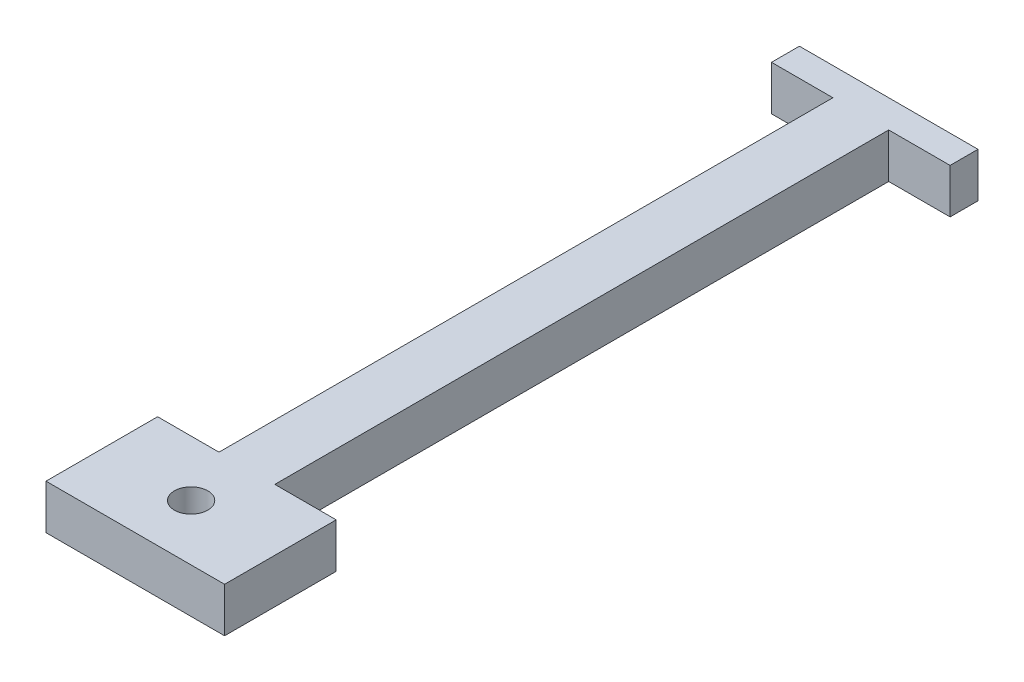
ISO-10303-21;
HEADER;
FILE_DESCRIPTION(('STEP AP214'),'2;1');
FILE_NAME('part.step','',(''),(''),'','','');
FILE_SCHEMA(('AUTOMOTIVE_DESIGN { 1 0 10303 214 1 1 1 1 }'));
ENDSEC;
DATA;
#1=APPLICATION_CONTEXT('core data for automotive mechanical design processes');
#2=APPLICATION_PROTOCOL_DEFINITION('international standard','automotive_design',2000,#1);
#3=PRODUCT_CONTEXT('',#1,'mechanical');
#4=PRODUCT('Part','Part','',(#3));
#5=PRODUCT_RELATED_PRODUCT_CATEGORY('part','',(#4));
#6=PRODUCT_DEFINITION_FORMATION('','',#4);
#7=PRODUCT_DEFINITION_CONTEXT('part definition',#1,'design');
#8=PRODUCT_DEFINITION('design','',#6,#7);
#9=PRODUCT_DEFINITION_SHAPE('','',#8);
#10=(LENGTH_UNIT() NAMED_UNIT(*) SI_UNIT(.MILLI.,.METRE.));
#11=(NAMED_UNIT(*) PLANE_ANGLE_UNIT() SI_UNIT($,.RADIAN.));
#12=(NAMED_UNIT(*) SI_UNIT($,.STERADIAN.) SOLID_ANGLE_UNIT());
#13=UNCERTAINTY_MEASURE_WITH_UNIT(LENGTH_MEASURE(1.E-05),#10,'distance_accuracy_value','');
#14=(GEOMETRIC_REPRESENTATION_CONTEXT(3) GLOBAL_UNCERTAINTY_ASSIGNED_CONTEXT((#13)) GLOBAL_UNIT_ASSIGNED_CONTEXT((#10,
#11,#12)) REPRESENTATION_CONTEXT('',''));
#15=CARTESIAN_POINT('',(0.,0.,0.));
#16=DIRECTION('',(0.,0.,1.));
#17=DIRECTION('',(1.,0.,0.));
#18=AXIS2_PLACEMENT_3D('',#15,#16,#17);
#19=CARTESIAN_POINT('',(2.5,4.,-55.));
#20=DIRECTION('',(-1.,0.,0.));
#21=DIRECTION('',(0.,0.,1.));
#22=AXIS2_PLACEMENT_3D('',#19,#20,#21);
#23=PLANE('',#22);
#24=DIRECTION('',(0.,0.,-1.));
#25=VECTOR('',#24,1.);
#26=CARTESIAN_POINT('',(2.5,0.,-55.));
#27=LINE('',#26,#25);
#28=CARTESIAN_POINT('',(2.49999999999999,0.,0.));
#29=VERTEX_POINT('',#28);
#30=CARTESIAN_POINT('',(2.5,0.,-55.));
#31=VERTEX_POINT('',#30);
#32=EDGE_CURVE('E132',#29,#31,#27,.T.);
#33=ORIENTED_EDGE('',*,*,#32,.T.);
#34=DIRECTION('',(0.,-1.,0.));
#35=VECTOR('',#34,1.);
#36=CARTESIAN_POINT('',(2.5,4.,-55.));
#37=LINE('',#36,#35);
#38=CARTESIAN_POINT('',(2.5,4.,-55.));
#39=VERTEX_POINT('',#38);
#40=EDGE_CURVE('E11',#39,#31,#37,.T.);
#41=ORIENTED_EDGE('',*,*,#40,.F.);
#42=DIRECTION('',(0.,0.,-1.));
#43=VECTOR('',#42,1.);
#44=CARTESIAN_POINT('',(2.5,4.,-55.));
#45=LINE('',#44,#43);
#46=CARTESIAN_POINT('',(2.49999999999999,4.,0.));
#47=VERTEX_POINT('',#46);
#48=EDGE_CURVE('E51',#47,#39,#45,.T.);
#49=ORIENTED_EDGE('',*,*,#48,.F.);
#50=DIRECTION('',(0.,-1.,0.));
#51=VECTOR('',#50,1.);
#52=CARTESIAN_POINT('',(2.49999999999999,4.,0.));
#53=LINE('',#52,#51);
#54=EDGE_CURVE('E83',#47,#29,#53,.T.);
#55=ORIENTED_EDGE('',*,*,#54,.T.);
#56=EDGE_LOOP('',(#33,#41,#49,#55));
#57=FACE_BOUND('',#56,.T.);
#58=ADVANCED_FACE('F34',(#57),#23,.F.);
#59=CARTESIAN_POINT('',(8.,4.,-55.));
#60=DIRECTION('',(0.,0.,-1.));
#61=DIRECTION('',(-1.,0.,0.));
#62=AXIS2_PLACEMENT_3D('',#59,#60,#61);
#63=PLANE('',#62);
#64=DIRECTION('',(1.,0.,0.));
#65=VECTOR('',#64,1.);
#66=CARTESIAN_POINT('',(8.,0.,-55.));
#67=LINE('',#66,#65);
#68=CARTESIAN_POINT('',(8.,0.,-55.));
#69=VERTEX_POINT('',#68);
#70=EDGE_CURVE('E134',#31,#69,#67,.T.);
#71=ORIENTED_EDGE('',*,*,#70,.T.);
#72=DIRECTION('',(0.,-1.,0.));
#73=VECTOR('',#72,1.);
#74=CARTESIAN_POINT('',(8.,4.,-55.));
#75=LINE('',#74,#73);
#76=CARTESIAN_POINT('',(8.,4.,-55.));
#77=VERTEX_POINT('',#76);
#78=EDGE_CURVE('E43',#77,#69,#75,.T.);
#79=ORIENTED_EDGE('',*,*,#78,.F.);
#80=DIRECTION('',(1.,0.,0.));
#81=VECTOR('',#80,1.);
#82=CARTESIAN_POINT('',(8.,4.,-55.));
#83=LINE('',#82,#81);
#84=EDGE_CURVE('E91',#39,#77,#83,.T.);
#85=ORIENTED_EDGE('',*,*,#84,.F.);
#86=ORIENTED_EDGE('',*,*,#40,.T.);
#87=EDGE_LOOP('',(#71,#79,#85,#86));
#88=FACE_BOUND('',#87,.T.);
#89=ADVANCED_FACE('F235',(#88),#63,.F.);
#90=CARTESIAN_POINT('',(8.,4.,-57.5));
#91=DIRECTION('',(-1.,0.,0.));
#92=DIRECTION('',(0.,0.,1.));
#93=AXIS2_PLACEMENT_3D('',#90,#91,#92);
#94=PLANE('',#93);
#95=DIRECTION('',(0.,0.,-1.));
#96=VECTOR('',#95,1.);
#97=CARTESIAN_POINT('',(8.,0.,-57.5));
#98=LINE('',#97,#96);
#99=CARTESIAN_POINT('',(8.,0.,-57.5));
#100=VERTEX_POINT('',#99);
#101=EDGE_CURVE('E137',#69,#100,#98,.T.);
#102=ORIENTED_EDGE('',*,*,#101,.T.);
#103=DIRECTION('',(0.,-1.,0.));
#104=VECTOR('',#103,1.);
#105=CARTESIAN_POINT('',(8.,4.,-57.5));
#106=LINE('',#105,#104);
#107=CARTESIAN_POINT('',(8.,4.,-57.5));
#108=VERTEX_POINT('',#107);
#109=EDGE_CURVE('E151',#108,#100,#106,.T.);
#110=ORIENTED_EDGE('',*,*,#109,.F.);
#111=DIRECTION('',(0.,0.,-1.));
#112=VECTOR('',#111,1.);
#113=CARTESIAN_POINT('',(8.,4.,-57.5));
#114=LINE('',#113,#112);
#115=EDGE_CURVE('E160',#77,#108,#114,.T.);
#116=ORIENTED_EDGE('',*,*,#115,.F.);
#117=ORIENTED_EDGE('',*,*,#78,.T.);
#118=EDGE_LOOP('',(#102,#110,#116,#117));
#119=FACE_BOUND('',#118,.T.);
#120=ADVANCED_FACE('F158',(#119),#94,.F.);
#121=CARTESIAN_POINT('',(8.,4.,-57.5));
#122=DIRECTION('',(0.,0.,1.));
#123=DIRECTION('',(1.,0.,0.));
#124=AXIS2_PLACEMENT_3D('',#121,#122,#123);
#125=PLANE('',#124);
#126=DIRECTION('',(-1.,0.,0.));
#127=VECTOR('',#126,1.);
#128=CARTESIAN_POINT('',(8.,0.,-57.5));
#129=LINE('',#128,#127);
#130=CARTESIAN_POINT('',(-8.,0.,-57.5));
#131=VERTEX_POINT('',#130);
#132=EDGE_CURVE('E139',#100,#131,#129,.T.);
#133=ORIENTED_EDGE('',*,*,#132,.T.);
#134=DIRECTION('',(0.,-1.,0.));
#135=VECTOR('',#134,1.);
#136=CARTESIAN_POINT('',(-8.,4.,-57.5));
#137=LINE('',#136,#135);
#138=CARTESIAN_POINT('',(-8.,4.,-57.5));
#139=VERTEX_POINT('',#138);
#140=EDGE_CURVE('E148',#139,#131,#137,.T.);
#141=ORIENTED_EDGE('',*,*,#140,.F.);
#142=DIRECTION('',(-1.,0.,0.));
#143=VECTOR('',#142,1.);
#144=CARTESIAN_POINT('',(8.,4.,-57.5));
#145=LINE('',#144,#143);
#146=EDGE_CURVE('E171',#108,#139,#145,.T.);
#147=ORIENTED_EDGE('',*,*,#146,.F.);
#148=ORIENTED_EDGE('',*,*,#109,.T.);
#149=EDGE_LOOP('',(#133,#141,#147,#148));
#150=FACE_BOUND('',#149,.T.);
#151=ADVANCED_FACE('F167',(#150),#125,.F.);
#152=CARTESIAN_POINT('',(-8.,4.,-57.5));
#153=DIRECTION('',(1.,0.,0.));
#154=DIRECTION('',(0.,0.,-1.));
#155=AXIS2_PLACEMENT_3D('',#152,#153,#154);
#156=PLANE('',#155);
#157=DIRECTION('',(0.,0.,1.));
#158=VECTOR('',#157,1.);
#159=CARTESIAN_POINT('',(-8.,0.,-57.5));
#160=LINE('',#159,#158);
#161=CARTESIAN_POINT('',(-8.,0.,-55.));
#162=VERTEX_POINT('',#161);
#163=EDGE_CURVE('E141',#131,#162,#160,.T.);
#164=ORIENTED_EDGE('',*,*,#163,.T.);
#165=DIRECTION('',(0.,-1.,0.));
#166=VECTOR('',#165,1.);
#167=CARTESIAN_POINT('',(-8.,4.,-55.));
#168=LINE('',#167,#166);
#169=CARTESIAN_POINT('',(-8.,4.,-55.));
#170=VERTEX_POINT('',#169);
#171=EDGE_CURVE('E122',#170,#162,#168,.T.);
#172=ORIENTED_EDGE('',*,*,#171,.F.);
#173=DIRECTION('',(0.,0.,1.));
#174=VECTOR('',#173,1.);
#175=CARTESIAN_POINT('',(-8.,4.,-57.5));
#176=LINE('',#175,#174);
#177=EDGE_CURVE('E114',#139,#170,#176,.T.);
#178=ORIENTED_EDGE('',*,*,#177,.F.);
#179=ORIENTED_EDGE('',*,*,#140,.T.);
#180=EDGE_LOOP('',(#164,#172,#178,#179));
#181=FACE_BOUND('',#180,.T.);
#182=ADVANCED_FACE('F170',(#181),#156,.F.);
#183=CARTESIAN_POINT('',(-8.,4.,-55.));
#184=DIRECTION('',(0.,0.,-1.));
#185=DIRECTION('',(-1.,0.,0.));
#186=AXIS2_PLACEMENT_3D('',#183,#184,#185);
#187=PLANE('',#186);
#188=DIRECTION('',(1.,0.,0.));
#189=VECTOR('',#188,1.);
#190=CARTESIAN_POINT('',(-8.,0.,-55.));
#191=LINE('',#190,#189);
#192=CARTESIAN_POINT('',(-2.5,0.,-55.));
#193=VERTEX_POINT('',#192);
#194=EDGE_CURVE('E79',#162,#193,#191,.T.);
#195=ORIENTED_EDGE('',*,*,#194,.T.);
#196=DIRECTION('',(0.,-1.,0.));
#197=VECTOR('',#196,1.);
#198=CARTESIAN_POINT('',(-2.5,4.,-55.));
#199=LINE('',#198,#197);
#200=CARTESIAN_POINT('',(-2.5,4.,-55.));
#201=VERTEX_POINT('',#200);
#202=EDGE_CURVE('E117',#201,#193,#199,.T.);
#203=ORIENTED_EDGE('',*,*,#202,.F.);
#204=DIRECTION('',(1.,0.,0.));
#205=VECTOR('',#204,1.);
#206=CARTESIAN_POINT('',(-8.,4.,-55.));
#207=LINE('',#206,#205);
#208=EDGE_CURVE('E107',#170,#201,#207,.T.);
#209=ORIENTED_EDGE('',*,*,#208,.F.);
#210=ORIENTED_EDGE('',*,*,#171,.T.);
#211=EDGE_LOOP('',(#195,#203,#209,#210));
#212=FACE_BOUND('',#211,.T.);
#213=ADVANCED_FACE('F118',(#212),#187,.F.);
#214=CARTESIAN_POINT('',(-2.5,4.,-55.));
#215=DIRECTION('',(1.,0.,0.));
#216=DIRECTION('',(0.,0.,-1.));
#217=AXIS2_PLACEMENT_3D('',#214,#215,#216);
#218=PLANE('',#217);
#219=DIRECTION('',(0.,0.,1.));
#220=VECTOR('',#219,1.);
#221=CARTESIAN_POINT('',(-2.5,0.,-55.));
#222=LINE('',#221,#220);
#223=CARTESIAN_POINT('',(-2.49999999999999,0.,0.));
#224=VERTEX_POINT('',#223);
#225=EDGE_CURVE('E144',#193,#224,#222,.T.);
#226=ORIENTED_EDGE('',*,*,#225,.T.);
#227=DIRECTION('',(0.,-1.,0.));
#228=VECTOR('',#227,1.);
#229=CARTESIAN_POINT('',(-2.49999999999999,4.,0.));
#230=LINE('',#229,#228);
#231=CARTESIAN_POINT('',(-2.49999999999999,4.,0.));
#232=VERTEX_POINT('',#231);
#233=EDGE_CURVE('E123',#232,#224,#230,.T.);
#234=ORIENTED_EDGE('',*,*,#233,.F.);
#235=DIRECTION('',(0.,0.,1.));
#236=VECTOR('',#235,1.);
#237=CARTESIAN_POINT('',(-2.5,4.,-55.));
#238=LINE('',#237,#236);
#239=EDGE_CURVE('E111',#201,#232,#238,.T.);
#240=ORIENTED_EDGE('',*,*,#239,.F.);
#241=ORIENTED_EDGE('',*,*,#202,.T.);
#242=EDGE_LOOP('',(#226,#234,#240,#241));
#243=FACE_BOUND('',#242,.T.);
#244=ADVANCED_FACE('F125',(#243),#218,.F.);
#245=CARTESIAN_POINT('',(0.,4.,0.));
#246=DIRECTION('',(0.,1.,0.));
#247=DIRECTION('',(0.,0.,1.));
#248=AXIS2_PLACEMENT_3D('',#245,#246,#247);
#249=PLANE('',#248);
#250=CARTESIAN_POINT('',(0.,4.,5.));
#251=DIRECTION('',(0.,1.,0.));
#252=DIRECTION('',(0.,0.,1.));
#253=AXIS2_PLACEMENT_3D('',#250,#251,#252);
#254=CIRCLE('',#253,1.5);
#255=CARTESIAN_POINT('',(0.,4.,6.5));
#256=VERTEX_POINT('',#255);
#257=EDGE_CURVE('E214',#256,#256,#254,.T.);
#258=ORIENTED_EDGE('',*,*,#257,.F.);
#259=EDGE_LOOP('',(#258));
#260=FACE_BOUND('',#259,.T.);
#261=ORIENTED_EDGE('',*,*,#48,.T.);
#262=ORIENTED_EDGE('',*,*,#84,.T.);
#263=ORIENTED_EDGE('',*,*,#115,.T.);
#264=ORIENTED_EDGE('',*,*,#146,.T.);
#265=ORIENTED_EDGE('',*,*,#177,.T.);
#266=ORIENTED_EDGE('',*,*,#208,.T.);
#267=ORIENTED_EDGE('',*,*,#239,.T.);
#268=DIRECTION('',(-1.,0.,0.));
#269=VECTOR('',#268,1.);
#270=CARTESIAN_POINT('',(-8.,4.,0.));
#271=LINE('',#270,#269);
#272=CARTESIAN_POINT('',(-8.,4.,0.));
#273=VERTEX_POINT('',#272);
#274=EDGE_CURVE('E193',#232,#273,#271,.T.);
#275=ORIENTED_EDGE('',*,*,#274,.T.);
#276=DIRECTION('',(0.,0.,-1.));
#277=VECTOR('',#276,1.);
#278=CARTESIAN_POINT('',(-8.,4.,10.));
#279=LINE('',#278,#277);
#280=CARTESIAN_POINT('',(-8.,4.,10.));
#281=VERTEX_POINT('',#280);
#282=EDGE_CURVE('E185',#281,#273,#279,.T.);
#283=ORIENTED_EDGE('',*,*,#282,.F.);
#284=DIRECTION('',(-1.,0.,0.));
#285=VECTOR('',#284,1.);
#286=CARTESIAN_POINT('',(-8.,4.,10.));
#287=LINE('',#286,#285);
#288=CARTESIAN_POINT('',(8.,4.,10.));
#289=VERTEX_POINT('',#288);
#290=EDGE_CURVE('E188',#289,#281,#287,.T.);
#291=ORIENTED_EDGE('',*,*,#290,.F.);
#292=DIRECTION('',(0.,0.,-1.));
#293=VECTOR('',#292,1.);
#294=CARTESIAN_POINT('',(8.,4.,10.));
#295=LINE('',#294,#293);
#296=CARTESIAN_POINT('',(8.,4.,0.));
#297=VERTEX_POINT('',#296);
#298=EDGE_CURVE('E182',#289,#297,#295,.T.);
#299=ORIENTED_EDGE('',*,*,#298,.T.);
#300=EDGE_CURVE('E189',#297,#47,#271,.T.);
#301=ORIENTED_EDGE('',*,*,#300,.T.);
#302=EDGE_LOOP('',(#261,#262,#263,#264,#265,#266,#267,#275,#283,#291,#299,#301));
#303=FACE_BOUND('',#302,.T.);
#304=ADVANCED_FACE('F108',(#260,#303),#249,.T.);
#305=CARTESIAN_POINT('',(0.,0.,0.));
#306=DIRECTION('',(0.,1.,0.));
#307=DIRECTION('',(0.,0.,1.));
#308=AXIS2_PLACEMENT_3D('',#305,#306,#307);
#309=PLANE('',#308);
#310=CARTESIAN_POINT('',(0.,0.,5.));
#311=DIRECTION('',(0.,1.,0.));
#312=DIRECTION('',(0.,0.,1.));
#313=AXIS2_PLACEMENT_3D('',#310,#311,#312);
#314=CIRCLE('',#313,1.5);
#315=CARTESIAN_POINT('',(0.,0.,6.5));
#316=VERTEX_POINT('',#315);
#317=EDGE_CURVE('E37',#316,#316,#314,.T.);
#318=ORIENTED_EDGE('',*,*,#317,.T.);
#319=EDGE_LOOP('',(#318));
#320=FACE_BOUND('',#319,.T.);
#321=ORIENTED_EDGE('',*,*,#32,.F.);
#322=DIRECTION('',(1.,0.,0.));
#323=VECTOR('',#322,1.);
#324=CARTESIAN_POINT('',(-8.,0.,0.));
#325=LINE('',#324,#323);
#326=CARTESIAN_POINT('',(8.,0.,0.));
#327=VERTEX_POINT('',#326);
#328=EDGE_CURVE('E200',#29,#327,#325,.T.);
#329=ORIENTED_EDGE('',*,*,#328,.T.);
#330=DIRECTION('',(0.,0.,-1.));
#331=VECTOR('',#330,1.);
#332=CARTESIAN_POINT('',(8.,0.,10.));
#333=LINE('',#332,#331);
#334=CARTESIAN_POINT('',(8.,0.,10.));
#335=VERTEX_POINT('',#334);
#336=EDGE_CURVE('E179',#335,#327,#333,.T.);
#337=ORIENTED_EDGE('',*,*,#336,.F.);
#338=DIRECTION('',(1.,0.,0.));
#339=VECTOR('',#338,1.);
#340=CARTESIAN_POINT('',(-8.,0.,10.));
#341=LINE('',#340,#339);
#342=CARTESIAN_POINT('',(-8.,0.,10.));
#343=VERTEX_POINT('',#342);
#344=EDGE_CURVE('E209',#343,#335,#341,.T.);
#345=ORIENTED_EDGE('',*,*,#344,.F.);
#346=DIRECTION('',(0.,0.,-1.));
#347=VECTOR('',#346,1.);
#348=CARTESIAN_POINT('',(-8.,0.,10.));
#349=LINE('',#348,#347);
#350=CARTESIAN_POINT('',(-8.,0.,0.));
#351=VERTEX_POINT('',#350);
#352=EDGE_CURVE('E135',#343,#351,#349,.T.);
#353=ORIENTED_EDGE('',*,*,#352,.T.);
#354=EDGE_CURVE('E197',#351,#224,#325,.T.);
#355=ORIENTED_EDGE('',*,*,#354,.T.);
#356=ORIENTED_EDGE('',*,*,#225,.F.);
#357=ORIENTED_EDGE('',*,*,#194,.F.);
#358=ORIENTED_EDGE('',*,*,#163,.F.);
#359=ORIENTED_EDGE('',*,*,#132,.F.);
#360=ORIENTED_EDGE('',*,*,#101,.F.);
#361=ORIENTED_EDGE('',*,*,#70,.F.);
#362=EDGE_LOOP('',(#321,#329,#337,#345,#353,#355,#356,#357,#358,#359,#360,#361));
#363=FACE_BOUND('',#362,.T.);
#364=ADVANCED_FACE('F163',(#320,#363),#309,.F.);
#365=CARTESIAN_POINT('',(0.,0.,0.));
#366=DIRECTION('',(0.,0.,1.));
#367=DIRECTION('',(1.,0.,0.));
#368=AXIS2_PLACEMENT_3D('',#365,#366,#367);
#369=PLANE('',#368);
#370=ORIENTED_EDGE('',*,*,#274,.F.);
#371=ORIENTED_EDGE('',*,*,#233,.T.);
#372=ORIENTED_EDGE('',*,*,#354,.F.);
#373=DIRECTION('',(0.,-1.,0.));
#374=VECTOR('',#373,1.);
#375=CARTESIAN_POINT('',(-8.,4.,0.));
#376=LINE('',#375,#374);
#377=EDGE_CURVE('E201',#273,#351,#376,.T.);
#378=ORIENTED_EDGE('',*,*,#377,.F.);
#379=EDGE_LOOP('',(#370,#371,#372,#378));
#380=FACE_BOUND('',#379,.T.);
#381=ADVANCED_FACE('F232',(#380),#369,.F.);
#382=CARTESIAN_POINT('',(-8.,4.,10.));
#383=DIRECTION('',(1.,0.,0.));
#384=DIRECTION('',(0.,0.,-1.));
#385=AXIS2_PLACEMENT_3D('',#382,#383,#384);
#386=PLANE('',#385);
#387=ORIENTED_EDGE('',*,*,#377,.T.);
#388=ORIENTED_EDGE('',*,*,#352,.F.);
#389=DIRECTION('',(0.,-1.,0.));
#390=VECTOR('',#389,1.);
#391=CARTESIAN_POINT('',(-8.,4.,10.));
#392=LINE('',#391,#390);
#393=EDGE_CURVE('E192',#281,#343,#392,.T.);
#394=ORIENTED_EDGE('',*,*,#393,.F.);
#395=ORIENTED_EDGE('',*,*,#282,.T.);
#396=EDGE_LOOP('',(#387,#388,#394,#395));
#397=FACE_BOUND('',#396,.T.);
#398=ADVANCED_FACE('F272',(#397),#386,.F.);
#399=CARTESIAN_POINT('',(8.,4.,10.));
#400=DIRECTION('',(-1.,0.,0.));
#401=DIRECTION('',(0.,0.,1.));
#402=AXIS2_PLACEMENT_3D('',#399,#400,#401);
#403=PLANE('',#402);
#404=DIRECTION('',(0.,1.,0.));
#405=VECTOR('',#404,1.);
#406=CARTESIAN_POINT('',(8.,4.,0.));
#407=LINE('',#406,#405);
#408=EDGE_CURVE('E194',#327,#297,#407,.T.);
#409=ORIENTED_EDGE('',*,*,#408,.T.);
#410=ORIENTED_EDGE('',*,*,#298,.F.);
#411=DIRECTION('',(0.,1.,0.));
#412=VECTOR('',#411,1.);
#413=CARTESIAN_POINT('',(8.,4.,10.));
#414=LINE('',#413,#412);
#415=EDGE_CURVE('E206',#335,#289,#414,.T.);
#416=ORIENTED_EDGE('',*,*,#415,.F.);
#417=ORIENTED_EDGE('',*,*,#336,.T.);
#418=EDGE_LOOP('',(#409,#410,#416,#417));
#419=FACE_BOUND('',#418,.T.);
#420=ADVANCED_FACE('F250',(#419),#403,.F.);
#421=CARTESIAN_POINT('',(0.,0.,10.));
#422=DIRECTION('',(0.,0.,1.));
#423=DIRECTION('',(1.,0.,0.));
#424=AXIS2_PLACEMENT_3D('',#421,#422,#423);
#425=PLANE('',#424);
#426=ORIENTED_EDGE('',*,*,#393,.T.);
#427=ORIENTED_EDGE('',*,*,#344,.T.);
#428=ORIENTED_EDGE('',*,*,#415,.T.);
#429=ORIENTED_EDGE('',*,*,#290,.T.);
#430=EDGE_LOOP('',(#426,#427,#428,#429));
#431=FACE_BOUND('',#430,.T.);
#432=ADVANCED_FACE('F229',(#431),#425,.T.);
#433=ORIENTED_EDGE('',*,*,#54,.F.);
#434=ORIENTED_EDGE('',*,*,#300,.F.);
#435=ORIENTED_EDGE('',*,*,#408,.F.);
#436=ORIENTED_EDGE('',*,*,#328,.F.);
#437=EDGE_LOOP('',(#433,#434,#435,#436));
#438=FACE_BOUND('',#437,.T.);
#439=ADVANCED_FACE('F224',(#438),#369,.F.);
#440=CARTESIAN_POINT('',(0.,-6.,5.));
#441=DIRECTION('',(0.,1.,0.));
#442=DIRECTION('',(0.,0.,1.));
#443=AXIS2_PLACEMENT_3D('',#440,#441,#442);
#444=CYLINDRICAL_SURFACE('',#443,1.5);
#445=ORIENTED_EDGE('',*,*,#257,.T.);
#446=EDGE_LOOP('',(#445));
#447=FACE_BOUND('',#446,.T.);
#448=ORIENTED_EDGE('',*,*,#317,.F.);
#449=EDGE_LOOP('',(#448));
#450=FACE_BOUND('',#449,.T.);
#451=ADVANCED_FACE('F222',(#447,#450),#444,.F.);
#452=CLOSED_SHELL('',(#58,#89,#120,#151,#182,#213,#244,#304,#364,#381,#398,#420,#432,#439,#451));
#453=MANIFOLD_SOLID_BREP('B2',#452);
#454=ADVANCED_BREP_SHAPE_REPRESENTATION('',(#18,#453),#14);
#455=SHAPE_DEFINITION_REPRESENTATION(#9,#454);
ENDSEC;
END-ISO-10303-21;
